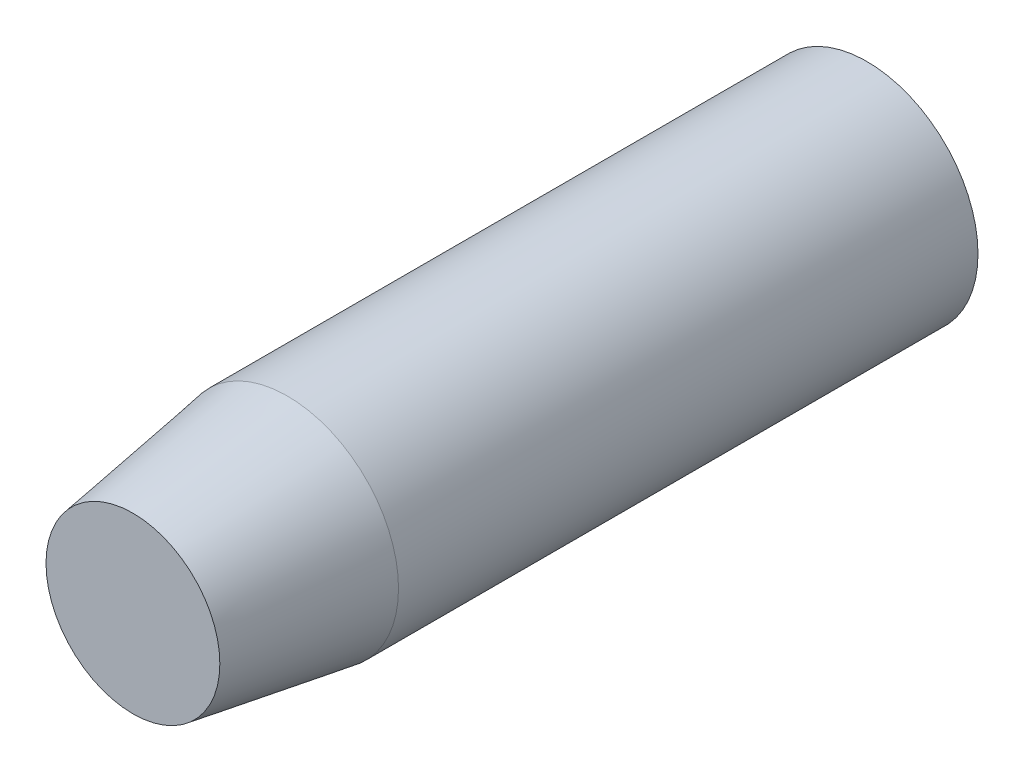
ISO-10303-21;
HEADER;
FILE_DESCRIPTION(('STEP AP214'),'2;1');
FILE_NAME('part.step','',(''),(''),'','','');
FILE_SCHEMA(('AUTOMOTIVE_DESIGN { 1 0 10303 214 1 1 1 1 }'));
ENDSEC;
DATA;
#1=APPLICATION_CONTEXT('core data for automotive mechanical design processes');
#2=APPLICATION_PROTOCOL_DEFINITION('international standard','automotive_design',2000,#1);
#3=PRODUCT_CONTEXT('',#1,'mechanical');
#4=PRODUCT('Part','Part','',(#3));
#5=PRODUCT_RELATED_PRODUCT_CATEGORY('part','',(#4));
#6=PRODUCT_DEFINITION_FORMATION('','',#4);
#7=PRODUCT_DEFINITION_CONTEXT('part definition',#1,'design');
#8=PRODUCT_DEFINITION('design','',#6,#7);
#9=PRODUCT_DEFINITION_SHAPE('','',#8);
#10=(LENGTH_UNIT() NAMED_UNIT(*) SI_UNIT(.MILLI.,.METRE.));
#11=(NAMED_UNIT(*) PLANE_ANGLE_UNIT() SI_UNIT($,.RADIAN.));
#12=(NAMED_UNIT(*) SI_UNIT($,.STERADIAN.) SOLID_ANGLE_UNIT());
#13=UNCERTAINTY_MEASURE_WITH_UNIT(LENGTH_MEASURE(1.E-05),#10,'distance_accuracy_value','');
#14=(GEOMETRIC_REPRESENTATION_CONTEXT(3) GLOBAL_UNCERTAINTY_ASSIGNED_CONTEXT((#13)) GLOBAL_UNIT_ASSIGNED_CONTEXT((#10,
#11,#12)) REPRESENTATION_CONTEXT('',''));
#15=CARTESIAN_POINT('',(0.,0.,0.));
#16=DIRECTION('',(0.,0.,1.));
#17=DIRECTION('',(1.,0.,0.));
#18=AXIS2_PLACEMENT_3D('',#15,#16,#17);
#19=CARTESIAN_POINT('',(0.,0.,60.325));
#20=DIRECTION('',(0.,0.,-1.));
#21=DIRECTION('',(-1.,0.,0.));
#22=AXIS2_PLACEMENT_3D('',#19,#20,#21);
#23=CYLINDRICAL_SURFACE('',#22,18.25625);
#24=CARTESIAN_POINT('',(0.,0.,34.9250000000015));
#25=DIRECTION('',(0.,0.,1.));
#26=DIRECTION('',(1.,0.,0.));
#27=AXIS2_PLACEMENT_3D('',#24,#25,#26);
#28=CIRCLE('',#27,18.25625);
#29=CARTESIAN_POINT('',(18.25625,0.,34.9250000000015));
#30=VERTEX_POINT('',#29);
#31=EDGE_CURVE('E10',#30,#30,#28,.F.);
#32=ORIENTED_EDGE('',*,*,#31,.T.);
#33=EDGE_LOOP('',(#32));
#34=FACE_BOUND('',#33,.T.);
#35=CARTESIAN_POINT('',(0.,0.,-60.325));
#36=DIRECTION('',(0.,0.,1.));
#37=DIRECTION('',(1.,0.,0.));
#38=AXIS2_PLACEMENT_3D('',#35,#36,#37);
#39=CIRCLE('',#38,18.25625);
#40=CARTESIAN_POINT('',(18.25625,0.,-60.325));
#41=VERTEX_POINT('',#40);
#42=EDGE_CURVE('E42',#41,#41,#39,.T.);
#43=ORIENTED_EDGE('',*,*,#42,.T.);
#44=EDGE_LOOP('',(#43));
#45=FACE_BOUND('',#44,.T.);
#46=ADVANCED_FACE('F31',(#34,#45),#23,.T.);
#47=CARTESIAN_POINT('',(0.,0.,60.325));
#48=DIRECTION('',(0.,0.,1.));
#49=DIRECTION('',(1.,0.,0.));
#50=AXIS2_PLACEMENT_3D('',#47,#48,#49);
#51=PLANE('',#50);
#52=CARTESIAN_POINT('',(0.,0.,60.325));
#53=DIRECTION('',(0.,0.,1.));
#54=DIRECTION('',(1.,0.,0.));
#55=AXIS2_PLACEMENT_3D('',#52,#53,#54);
#56=CIRCLE('',#55,14.2875000000003);
#57=CARTESIAN_POINT('',(14.2875000000003,0.,60.325));
#58=VERTEX_POINT('',#57);
#59=EDGE_CURVE('E38',#58,#58,#56,.T.);
#60=ORIENTED_EDGE('',*,*,#59,.T.);
#61=EDGE_LOOP('',(#60));
#62=FACE_BOUND('',#61,.T.);
#63=ADVANCED_FACE('F52',(#62),#51,.T.);
#64=CARTESIAN_POINT('',(0.,0.,-60.325));
#65=DIRECTION('',(0.,0.,1.));
#66=DIRECTION('',(1.,0.,0.));
#67=AXIS2_PLACEMENT_3D('',#64,#65,#66);
#68=PLANE('',#67);
#69=ORIENTED_EDGE('',*,*,#42,.F.);
#70=EDGE_LOOP('',(#69));
#71=FACE_BOUND('',#70,.T.);
#72=ADVANCED_FACE('F50',(#71),#68,.F.);
#73=CARTESIAN_POINT('',(0.,0.,60.325));
#74=DIRECTION('',(0.,0.,-1.));
#75=DIRECTION('',(-1.,0.,0.));
#76=AXIS2_PLACEMENT_3D('',#73,#74,#75);
#77=CONICAL_SURFACE('',#76,14.2875000000003,0.154996741923938);
#78=ORIENTED_EDGE('',*,*,#31,.F.);
#79=EDGE_LOOP('',(#78));
#80=FACE_BOUND('',#79,.T.);
#81=ORIENTED_EDGE('',*,*,#59,.F.);
#82=EDGE_LOOP('',(#81));
#83=FACE_BOUND('',#82,.T.);
#84=ADVANCED_FACE('F33',(#80,#83),#77,.T.);
#85=CLOSED_SHELL('',(#46,#63,#72,#84));
#86=MANIFOLD_SOLID_BREP('B2',#85);
#87=ADVANCED_BREP_SHAPE_REPRESENTATION('',(#18,#86),#14);
#88=SHAPE_DEFINITION_REPRESENTATION(#9,#87);
ENDSEC;
END-ISO-10303-21;
